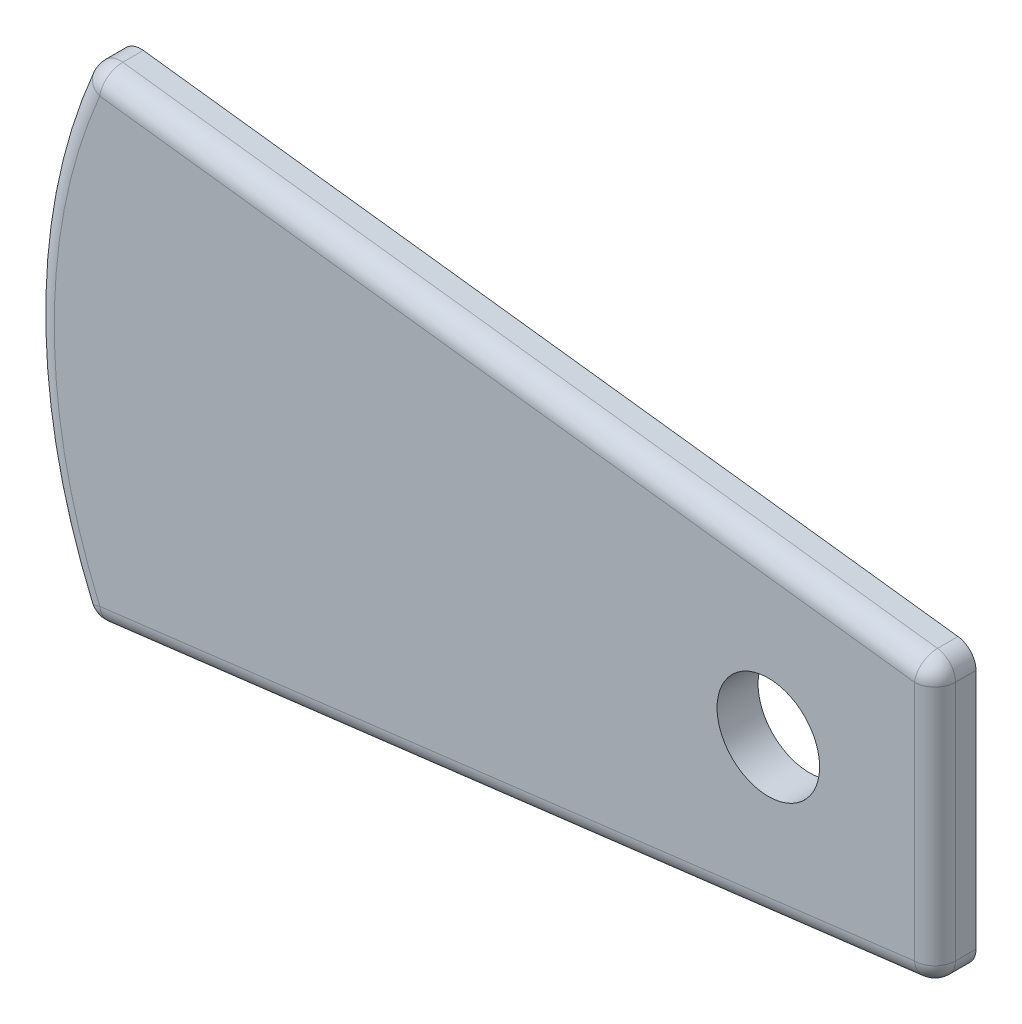
ISO-10303-21;
HEADER;
FILE_DESCRIPTION(('STEP AP214'),'2;1');
FILE_NAME('part.step','',(''),(''),'','','');
FILE_SCHEMA(('AUTOMOTIVE_DESIGN { 1 0 10303 214 1 1 1 1 }'));
ENDSEC;
DATA;
#1=APPLICATION_CONTEXT('core data for automotive mechanical design processes');
#2=APPLICATION_PROTOCOL_DEFINITION('international standard','automotive_design',2000,#1);
#3=PRODUCT_CONTEXT('',#1,'mechanical');
#4=PRODUCT('Part','Part','',(#3));
#5=PRODUCT_RELATED_PRODUCT_CATEGORY('part','',(#4));
#6=PRODUCT_DEFINITION_FORMATION('','',#4);
#7=PRODUCT_DEFINITION_CONTEXT('part definition',#1,'design');
#8=PRODUCT_DEFINITION('design','',#6,#7);
#9=PRODUCT_DEFINITION_SHAPE('','',#8);
#10=(LENGTH_UNIT() NAMED_UNIT(*) SI_UNIT(.MILLI.,.METRE.));
#11=(NAMED_UNIT(*) PLANE_ANGLE_UNIT() SI_UNIT($,.RADIAN.));
#12=(NAMED_UNIT(*) SI_UNIT($,.STERADIAN.) SOLID_ANGLE_UNIT());
#13=UNCERTAINTY_MEASURE_WITH_UNIT(LENGTH_MEASURE(1.E-05),#10,'distance_accuracy_value','');
#14=(GEOMETRIC_REPRESENTATION_CONTEXT(3) GLOBAL_UNCERTAINTY_ASSIGNED_CONTEXT((#13)) GLOBAL_UNIT_ASSIGNED_CONTEXT((#10,
#11,#12)) REPRESENTATION_CONTEXT('',''));
#15=CARTESIAN_POINT('',(0.,0.,0.));
#16=DIRECTION('',(0.,0.,1.));
#17=DIRECTION('',(1.,0.,0.));
#18=AXIS2_PLACEMENT_3D('',#15,#16,#17);
#19=CARTESIAN_POINT('',(-47.5934740970987,40.,2.));
#20=DIRECTION('',(0.,0.,-1.));
#21=DIRECTION('',(-1.,0.,0.));
#22=AXIS2_PLACEMENT_3D('',#19,#20,#21);
#23=CYLINDRICAL_SURFACE('',#22,28.2250701026764);
#24=DIRECTION('',(0.,0.,-1.));
#25=VECTOR('',#24,1.);
#26=CARTESIAN_POINT('',(-73.5154300505367,28.8327809258966,2.));
#27=LINE('',#26,#25);
#28=CARTESIAN_POINT('',(-73.5154300505367,28.8327809258966,0.));
#29=VERTEX_POINT('',#28);
#30=CARTESIAN_POINT('',(-73.5154300505367,28.8327809258966,1.));
#31=VERTEX_POINT('',#30);
#32=EDGE_CURVE('E124',#29,#31,#27,.F.);
#33=ORIENTED_EDGE('',*,*,#32,.T.);
#34=CARTESIAN_POINT('',(-47.5934740970987,40.,1.));
#35=DIRECTION('',(0.,0.,-1.));
#36=DIRECTION('',(-1.,0.,0.));
#37=AXIS2_PLACEMENT_3D('',#34,#35,#36);
#38=CIRCLE('',#37,28.2250701026764);
#39=CARTESIAN_POINT('',(-73.5154300505367,51.1672190741034,1.));
#40=VERTEX_POINT('',#39);
#41=EDGE_CURVE('E11',#31,#40,#38,.T.);
#42=ORIENTED_EDGE('',*,*,#41,.T.);
#43=DIRECTION('',(0.,0.,-1.));
#44=VECTOR('',#43,1.);
#45=CARTESIAN_POINT('',(-73.5154300505367,51.1672190741034,2.));
#46=LINE('',#45,#44);
#47=CARTESIAN_POINT('',(-73.5154300505367,51.1672190741034,0.));
#48=VERTEX_POINT('',#47);
#49=EDGE_CURVE('E128',#40,#48,#46,.T.);
#50=ORIENTED_EDGE('',*,*,#49,.T.);
#51=CARTESIAN_POINT('',(-47.5934740970987,40.,0.));
#52=DIRECTION('',(0.,0.,1.));
#53=DIRECTION('',(-1.,0.,0.));
#54=AXIS2_PLACEMENT_3D('',#51,#52,#53);
#55=CIRCLE('',#54,28.2250701026764);
#56=EDGE_CURVE('E135',#48,#29,#55,.T.);
#57=ORIENTED_EDGE('',*,*,#56,.T.);
#58=EDGE_LOOP('',(#33,#42,#50,#57));
#59=FACE_BOUND('',#58,.T.);
#60=ADVANCED_FACE('F35',(#59),#23,.T.);
#61=CARTESIAN_POINT('',(-31.8738828691352,33.2309933523723,2.));
#62=DIRECTION('',(-0.122107751234225,0.99251684977562,0.));
#63=DIRECTION('',(-0.99251684977562,-0.122107751234225,0.));
#64=AXIS2_PLACEMENT_3D('',#61,#62,#63);
#65=PLANE('',#64);
#66=DIRECTION('',(0.,0.,-1.));
#67=VECTOR('',#66,1.);
#68=CARTESIAN_POINT('',(-32.751775117901,33.1229876813885,2.));
#69=LINE('',#68,#67);
#70=CARTESIAN_POINT('',(-32.751775117901,33.1229876813885,0.));
#71=VERTEX_POINT('',#70);
#72=CARTESIAN_POINT('',(-32.751775117901,33.1229876813885,1.));
#73=VERTEX_POINT('',#72);
#74=EDGE_CURVE('E120',#71,#73,#69,.F.);
#75=ORIENTED_EDGE('',*,*,#74,.T.);
#76=DIRECTION('',(0.99251684977562,0.122107751234225,0.));
#77=VECTOR('',#76,1.);
#78=CARTESIAN_POINT('',(-31.8738828691352,33.2309933523723,1.));
#79=LINE('',#78,#77);
#80=CARTESIAN_POINT('',(-72.4749204721629,28.2359130163531,1.));
#81=VERTEX_POINT('',#80);
#82=EDGE_CURVE('E59',#73,#81,#79,.F.);
#83=ORIENTED_EDGE('',*,*,#82,.T.);
#84=DIRECTION('',(0.,0.,-1.));
#85=VECTOR('',#84,1.);
#86=CARTESIAN_POINT('',(-72.4749204721629,28.2359130163531,2.));
#87=LINE('',#86,#85);
#88=CARTESIAN_POINT('',(-72.4749204721629,28.2359130163531,0.));
#89=VERTEX_POINT('',#88);
#90=EDGE_CURVE('E112',#81,#89,#87,.T.);
#91=ORIENTED_EDGE('',*,*,#90,.T.);
#92=DIRECTION('',(0.99251684977562,0.122107751234225,0.));
#93=VECTOR('',#92,1.);
#94=CARTESIAN_POINT('',(-31.8738828691352,33.2309933523723,0.));
#95=LINE('',#94,#93);
#96=EDGE_CURVE('E116',#89,#71,#95,.T.);
#97=ORIENTED_EDGE('',*,*,#96,.T.);
#98=EDGE_LOOP('',(#75,#83,#91,#97));
#99=FACE_BOUND('',#98,.T.);
#100=ADVANCED_FACE('F114',(#99),#65,.F.);
#101=CARTESIAN_POINT('',(-31.8738828691352,46.7690066476277,2.));
#102=DIRECTION('',(-1.,0.,0.));
#103=DIRECTION('',(0.,0.,1.));
#104=AXIS2_PLACEMENT_3D('',#101,#102,#103);
#105=PLANE('',#104);
#106=DIRECTION('',(0.,0.,-1.));
#107=VECTOR('',#106,1.);
#108=CARTESIAN_POINT('',(-31.8738828691352,45.8844954688359,2.));
#109=LINE('',#108,#107);
#110=CARTESIAN_POINT('',(-31.8738828691352,45.8844954688359,0.));
#111=VERTEX_POINT('',#110);
#112=CARTESIAN_POINT('',(-31.8738828691352,45.8844954688359,1.));
#113=VERTEX_POINT('',#112);
#114=EDGE_CURVE('E159',#111,#113,#109,.F.);
#115=ORIENTED_EDGE('',*,*,#114,.T.);
#116=DIRECTION('',(0.,1.,0.));
#117=VECTOR('',#116,1.);
#118=CARTESIAN_POINT('',(-31.8738828691352,46.7690066476277,1.));
#119=LINE('',#118,#117);
#120=CARTESIAN_POINT('',(-31.8738828691352,34.1155045311641,1.));
#121=VERTEX_POINT('',#120);
#122=EDGE_CURVE('E178',#113,#121,#119,.F.);
#123=ORIENTED_EDGE('',*,*,#122,.T.);
#124=DIRECTION('',(0.,0.,-1.));
#125=VECTOR('',#124,1.);
#126=CARTESIAN_POINT('',(-31.8738828691352,34.1155045311641,2.));
#127=LINE('',#126,#125);
#128=CARTESIAN_POINT('',(-31.8738828691352,34.1155045311641,0.));
#129=VERTEX_POINT('',#128);
#130=EDGE_CURVE('E157',#121,#129,#127,.T.);
#131=ORIENTED_EDGE('',*,*,#130,.T.);
#132=DIRECTION('',(0.,1.,0.));
#133=VECTOR('',#132,1.);
#134=CARTESIAN_POINT('',(-31.8738828691352,46.7690066476277,0.));
#135=LINE('',#134,#133);
#136=EDGE_CURVE('E134',#129,#111,#135,.T.);
#137=ORIENTED_EDGE('',*,*,#136,.T.);
#138=EDGE_LOOP('',(#115,#123,#131,#137));
#139=FACE_BOUND('',#138,.T.);
#140=ADVANCED_FACE('F218',(#139),#105,.F.);
#141=CARTESIAN_POINT('',(-31.8738828691352,46.7690066476277,2.));
#142=DIRECTION('',(-0.122107751234225,-0.99251684977562,0.));
#143=DIRECTION('',(0.99251684977562,-0.122107751234225,0.));
#144=AXIS2_PLACEMENT_3D('',#141,#142,#143);
#145=PLANE('',#144);
#146=DIRECTION('',(0.,0.,-1.));
#147=VECTOR('',#146,1.);
#148=CARTESIAN_POINT('',(-72.4749204721629,51.7640869836469,2.));
#149=LINE('',#148,#147);
#150=CARTESIAN_POINT('',(-72.4749204721629,51.7640869836469,0.));
#151=VERTEX_POINT('',#150);
#152=CARTESIAN_POINT('',(-72.4749204721629,51.7640869836469,1.));
#153=VERTEX_POINT('',#152);
#154=EDGE_CURVE('E154',#151,#153,#149,.F.);
#155=ORIENTED_EDGE('',*,*,#154,.T.);
#156=DIRECTION('',(-0.99251684977562,0.122107751234225,0.));
#157=VECTOR('',#156,1.);
#158=CARTESIAN_POINT('',(-31.8738828691352,46.7690066476277,1.));
#159=LINE('',#158,#157);
#160=CARTESIAN_POINT('',(-32.751775117901,46.8770123186115,1.));
#161=VERTEX_POINT('',#160);
#162=EDGE_CURVE('E174',#153,#161,#159,.F.);
#163=ORIENTED_EDGE('',*,*,#162,.T.);
#164=DIRECTION('',(0.,0.,-1.));
#165=VECTOR('',#164,1.);
#166=CARTESIAN_POINT('',(-32.751775117901,46.8770123186115,2.));
#167=LINE('',#166,#165);
#168=CARTESIAN_POINT('',(-32.751775117901,46.8770123186115,0.));
#169=VERTEX_POINT('',#168);
#170=EDGE_CURVE('E152',#161,#169,#167,.T.);
#171=ORIENTED_EDGE('',*,*,#170,.T.);
#172=DIRECTION('',(-0.99251684977562,0.122107751234225,0.));
#173=VECTOR('',#172,1.);
#174=CARTESIAN_POINT('',(-31.8738828691352,46.7690066476277,0.));
#175=LINE('',#174,#173);
#176=EDGE_CURVE('E138',#169,#151,#175,.T.);
#177=ORIENTED_EDGE('',*,*,#176,.T.);
#178=EDGE_LOOP('',(#155,#163,#171,#177));
#179=FACE_BOUND('',#178,.T.);
#180=ADVANCED_FACE('F318',(#179),#145,.F.);
#181=CARTESIAN_POINT('',(-47.5934740970987,40.,2.));
#182=DIRECTION('',(0.,0.,-1.));
#183=DIRECTION('',(-1.,0.,0.));
#184=AXIS2_PLACEMENT_3D('',#181,#182,#183);
#185=PLANE('',#184);
#186=CARTESIAN_POINT('',(-40.,40.,2.));
#187=DIRECTION('',(0.,0.,1.));
#188=DIRECTION('',(1.,0.,0.));
#189=AXIS2_PLACEMENT_3D('',#186,#187,#188);
#190=CIRCLE('',#189,2.5);
#191=CARTESIAN_POINT('',(-37.5,40.,2.));
#192=VERTEX_POINT('',#191);
#193=EDGE_CURVE('E420',#192,#192,#190,.T.);
#194=ORIENTED_EDGE('',*,*,#193,.F.);
#195=EDGE_LOOP('',(#194));
#196=FACE_BOUND('',#195,.T.);
#197=DIRECTION('',(0.,1.,0.));
#198=VECTOR('',#197,1.);
#199=CARTESIAN_POINT('',(-32.8738828691352,40.,2.));
#200=LINE('',#199,#198);
#201=CARTESIAN_POINT('',(-32.8738828691352,34.1155045311641,2.));
#202=VERTEX_POINT('',#201);
#203=CARTESIAN_POINT('',(-32.8738828691352,45.8844954688359,2.));
#204=VERTEX_POINT('',#203);
#205=EDGE_CURVE('E169',#202,#204,#200,.T.);
#206=ORIENTED_EDGE('',*,*,#205,.T.);
#207=DIRECTION('',(-0.99251684977562,0.122107751234225,0.));
#208=VECTOR('',#207,1.);
#209=CARTESIAN_POINT('',(-46.6608349858454,47.5806820068538,2.));
#210=LINE('',#209,#208);
#211=CARTESIAN_POINT('',(-72.5970282233972,50.7715701338712,2.));
#212=VERTEX_POINT('',#211);
#213=EDGE_CURVE('E171',#204,#212,#210,.T.);
#214=ORIENTED_EDGE('',*,*,#213,.T.);
#215=CARTESIAN_POINT('',(-47.5934740970987,40.,2.));
#216=DIRECTION('',(0.,0.,-1.));
#217=DIRECTION('',(-1.,0.,0.));
#218=AXIS2_PLACEMENT_3D('',#215,#216,#217);
#219=CIRCLE('',#218,27.2250701026764);
#220=CARTESIAN_POINT('',(-72.5970282233972,29.2284298661288,2.));
#221=VERTEX_POINT('',#220);
#222=EDGE_CURVE('E165',#212,#221,#219,.F.);
#223=ORIENTED_EDGE('',*,*,#222,.T.);
#224=DIRECTION('',(0.99251684977562,0.122107751234225,0.));
#225=VECTOR('',#224,1.);
#226=CARTESIAN_POINT('',(-46.6608349858454,32.4193179931462,2.));
#227=LINE('',#226,#225);
#228=EDGE_CURVE('E167',#221,#202,#227,.T.);
#229=ORIENTED_EDGE('',*,*,#228,.T.);
#230=EDGE_LOOP('',(#206,#214,#223,#229));
#231=FACE_BOUND('',#230,.T.);
#232=ADVANCED_FACE('F236',(#196,#231),#185,.F.);
#233=CARTESIAN_POINT('',(-47.5934740970987,40.,0.));
#234=DIRECTION('',(0.,0.,-1.));
#235=DIRECTION('',(-1.,0.,0.));
#236=AXIS2_PLACEMENT_3D('',#233,#234,#235);
#237=PLANE('',#236);
#238=CARTESIAN_POINT('',(-40.,40.,0.));
#239=DIRECTION('',(0.,0.,1.));
#240=DIRECTION('',(1.,0.,0.));
#241=AXIS2_PLACEMENT_3D('',#238,#239,#240);
#242=CIRCLE('',#241,2.5);
#243=CARTESIAN_POINT('',(-37.5,40.,0.));
#244=VERTEX_POINT('',#243);
#245=EDGE_CURVE('E187',#244,#244,#242,.T.);
#246=ORIENTED_EDGE('',*,*,#245,.T.);
#247=EDGE_LOOP('',(#246));
#248=FACE_BOUND('',#247,.T.);
#249=ORIENTED_EDGE('',*,*,#96,.F.);
#250=CARTESIAN_POINT('',(-72.5970282233972,29.2284298661288,0.));
#251=DIRECTION('',(0.,0.,-1.));
#252=DIRECTION('',(-1.,0.,0.));
#253=AXIS2_PLACEMENT_3D('',#250,#251,#252);
#254=CIRCLE('',#253,1.);
#255=EDGE_CURVE('E122',#89,#29,#254,.T.);
#256=ORIENTED_EDGE('',*,*,#255,.T.);
#257=ORIENTED_EDGE('',*,*,#56,.F.);
#258=CARTESIAN_POINT('',(-72.5970282233972,50.7715701338712,0.));
#259=DIRECTION('',(0.,0.,-1.));
#260=DIRECTION('',(-1.,0.,0.));
#261=AXIS2_PLACEMENT_3D('',#258,#259,#260);
#262=CIRCLE('',#261,1.);
#263=EDGE_CURVE('E129',#48,#151,#262,.T.);
#264=ORIENTED_EDGE('',*,*,#263,.T.);
#265=ORIENTED_EDGE('',*,*,#176,.F.);
#266=CARTESIAN_POINT('',(-32.8738828691352,45.8844954688359,0.));
#267=DIRECTION('',(0.,0.,-1.));
#268=DIRECTION('',(-1.,0.,0.));
#269=AXIS2_PLACEMENT_3D('',#266,#267,#268);
#270=CIRCLE('',#269,1.);
#271=EDGE_CURVE('E147',#169,#111,#270,.T.);
#272=ORIENTED_EDGE('',*,*,#271,.T.);
#273=ORIENTED_EDGE('',*,*,#136,.F.);
#274=CARTESIAN_POINT('',(-32.8738828691352,34.1155045311641,0.));
#275=DIRECTION('',(0.,0.,-1.));
#276=DIRECTION('',(-1.,0.,0.));
#277=AXIS2_PLACEMENT_3D('',#274,#275,#276);
#278=CIRCLE('',#277,1.);
#279=EDGE_CURVE('E119',#129,#71,#278,.T.);
#280=ORIENTED_EDGE('',*,*,#279,.T.);
#281=EDGE_LOOP('',(#249,#256,#257,#264,#265,#272,#273,#280));
#282=FACE_BOUND('',#281,.T.);
#283=ADVANCED_FACE('F131',(#248,#282),#237,.T.);
#284=CARTESIAN_POINT('',(-72.5970282233972,29.2284298661288,2.));
#285=DIRECTION('',(0.,0.,-1.));
#286=DIRECTION('',(-1.,0.,0.));
#287=AXIS2_PLACEMENT_3D('',#284,#285,#286);
#288=CYLINDRICAL_SURFACE('',#287,1.);
#289=ORIENTED_EDGE('',*,*,#90,.F.);
#290=CARTESIAN_POINT('',(-72.5970282233972,29.2284298661288,1.));
#291=DIRECTION('',(0.,0.,-1.));
#292=DIRECTION('',(-1.,0.,0.));
#293=AXIS2_PLACEMENT_3D('',#290,#291,#292);
#294=CIRCLE('',#293,1.);
#295=EDGE_CURVE('E44',#81,#31,#294,.T.);
#296=ORIENTED_EDGE('',*,*,#295,.T.);
#297=ORIENTED_EDGE('',*,*,#32,.F.);
#298=ORIENTED_EDGE('',*,*,#255,.F.);
#299=EDGE_LOOP('',(#289,#296,#297,#298));
#300=FACE_BOUND('',#299,.T.);
#301=ADVANCED_FACE('F123',(#300),#288,.T.);
#302=CARTESIAN_POINT('',(-72.5970282233972,50.7715701338712,2.));
#303=DIRECTION('',(0.,0.,-1.));
#304=DIRECTION('',(-1.,0.,0.));
#305=AXIS2_PLACEMENT_3D('',#302,#303,#304);
#306=CYLINDRICAL_SURFACE('',#305,1.);
#307=ORIENTED_EDGE('',*,*,#49,.F.);
#308=CARTESIAN_POINT('',(-72.5970282233972,50.7715701338712,1.));
#309=DIRECTION('',(0.,0.,-1.));
#310=DIRECTION('',(-1.,0.,0.));
#311=AXIS2_PLACEMENT_3D('',#308,#309,#310);
#312=CIRCLE('',#311,1.);
#313=EDGE_CURVE('E162',#40,#153,#312,.T.);
#314=ORIENTED_EDGE('',*,*,#313,.T.);
#315=ORIENTED_EDGE('',*,*,#154,.F.);
#316=ORIENTED_EDGE('',*,*,#263,.F.);
#317=EDGE_LOOP('',(#307,#314,#315,#316));
#318=FACE_BOUND('',#317,.T.);
#319=ADVANCED_FACE('F250',(#318),#306,.T.);
#320=CARTESIAN_POINT('',(-32.8738828691352,45.8844954688359,2.));
#321=DIRECTION('',(0.,0.,-1.));
#322=DIRECTION('',(-1.,0.,0.));
#323=AXIS2_PLACEMENT_3D('',#320,#321,#322);
#324=CYLINDRICAL_SURFACE('',#323,1.);
#325=ORIENTED_EDGE('',*,*,#170,.F.);
#326=CARTESIAN_POINT('',(-32.8738828691352,45.8844954688359,1.));
#327=DIRECTION('',(0.,0.,-1.));
#328=DIRECTION('',(-1.,0.,0.));
#329=AXIS2_PLACEMENT_3D('',#326,#327,#328);
#330=CIRCLE('',#329,1.);
#331=EDGE_CURVE('E176',#161,#113,#330,.T.);
#332=ORIENTED_EDGE('',*,*,#331,.T.);
#333=ORIENTED_EDGE('',*,*,#114,.F.);
#334=ORIENTED_EDGE('',*,*,#271,.F.);
#335=EDGE_LOOP('',(#325,#332,#333,#334));
#336=FACE_BOUND('',#335,.T.);
#337=ADVANCED_FACE('F223',(#336),#324,.T.);
#338=CARTESIAN_POINT('',(-32.8738828691352,34.1155045311641,2.));
#339=DIRECTION('',(0.,0.,-1.));
#340=DIRECTION('',(-1.,0.,0.));
#341=AXIS2_PLACEMENT_3D('',#338,#339,#340);
#342=CYLINDRICAL_SURFACE('',#341,1.);
#343=ORIENTED_EDGE('',*,*,#130,.F.);
#344=CARTESIAN_POINT('',(-32.8738828691352,34.1155045311641,1.));
#345=DIRECTION('',(0.,0.,-1.));
#346=DIRECTION('',(-1.,0.,0.));
#347=AXIS2_PLACEMENT_3D('',#344,#345,#346);
#348=CIRCLE('',#347,1.);
#349=EDGE_CURVE('E180',#121,#73,#348,.T.);
#350=ORIENTED_EDGE('',*,*,#349,.T.);
#351=ORIENTED_EDGE('',*,*,#74,.F.);
#352=ORIENTED_EDGE('',*,*,#279,.F.);
#353=EDGE_LOOP('',(#343,#350,#351,#352));
#354=FACE_BOUND('',#353,.T.);
#355=ADVANCED_FACE('F216',(#354),#342,.T.);
#356=CARTESIAN_POINT('',(-32.8738828691352,34.1155045311641,1.));
#357=DIRECTION('',(0.,0.,-1.));
#358=DIRECTION('',(-1.,0.,0.));
#359=AXIS2_PLACEMENT_3D('',#356,#357,#358);
#360=SPHERICAL_SURFACE('',#359,1.);
#361=CARTESIAN_POINT('',(-32.8738828691352,34.1155045311641,1.));
#362=DIRECTION('',(-0.99251684977562,-0.122107751234223,0.));
#363=DIRECTION('',(0.122107751234223,-0.99251684977562,0.));
#364=AXIS2_PLACEMENT_3D('',#361,#362,#363);
#365=CIRCLE('',#364,1.);
#366=EDGE_CURVE('E200',#73,#202,#365,.T.);
#367=ORIENTED_EDGE('',*,*,#366,.F.);
#368=ORIENTED_EDGE('',*,*,#349,.F.);
#369=CARTESIAN_POINT('',(-32.8738828691352,34.1155045311641,1.));
#370=DIRECTION('',(0.,1.,0.));
#371=DIRECTION('',(0.,0.,1.));
#372=AXIS2_PLACEMENT_3D('',#369,#370,#371);
#373=CIRCLE('',#372,1.);
#374=EDGE_CURVE('E39',#202,#121,#373,.T.);
#375=ORIENTED_EDGE('',*,*,#374,.F.);
#376=EDGE_LOOP('',(#367,#368,#375));
#377=FACE_BOUND('',#376,.T.);
#378=ADVANCED_FACE('F37',(#377),#360,.T.);
#379=CARTESIAN_POINT('',(-32.8738828691352,40.,1.));
#380=DIRECTION('',(0.,1.,0.));
#381=DIRECTION('',(0.,0.,1.));
#382=AXIS2_PLACEMENT_3D('',#379,#380,#381);
#383=CYLINDRICAL_SURFACE('',#382,1.);
#384=ORIENTED_EDGE('',*,*,#374,.T.);
#385=ORIENTED_EDGE('',*,*,#122,.F.);
#386=CARTESIAN_POINT('',(-32.8738828691352,45.8844954688359,1.));
#387=DIRECTION('',(0.,1.,0.));
#388=DIRECTION('',(0.,0.,1.));
#389=AXIS2_PLACEMENT_3D('',#386,#387,#388);
#390=CIRCLE('',#389,1.);
#391=EDGE_CURVE('E198',#204,#113,#390,.T.);
#392=ORIENTED_EDGE('',*,*,#391,.F.);
#393=ORIENTED_EDGE('',*,*,#205,.F.);
#394=EDGE_LOOP('',(#384,#385,#392,#393));
#395=FACE_BOUND('',#394,.T.);
#396=ADVANCED_FACE('F210',(#395),#383,.T.);
#397=CARTESIAN_POINT('',(-46.6608349858454,32.4193179931462,1.));
#398=DIRECTION('',(0.99251684977562,0.122107751234225,0.));
#399=DIRECTION('',(-0.122107751234225,0.99251684977562,0.));
#400=AXIS2_PLACEMENT_3D('',#397,#398,#399);
#401=CYLINDRICAL_SURFACE('',#400,1.);
#402=ORIENTED_EDGE('',*,*,#366,.T.);
#403=ORIENTED_EDGE('',*,*,#228,.F.);
#404=CARTESIAN_POINT('',(-72.5970282233972,29.2284298661288,1.));
#405=DIRECTION('',(-0.99251684977562,-0.122107751234224,0.));
#406=DIRECTION('',(0.122107751234224,-0.99251684977562,0.));
#407=AXIS2_PLACEMENT_3D('',#404,#405,#406);
#408=CIRCLE('',#407,1.);
#409=EDGE_CURVE('E195',#81,#221,#408,.T.);
#410=ORIENTED_EDGE('',*,*,#409,.F.);
#411=ORIENTED_EDGE('',*,*,#82,.F.);
#412=EDGE_LOOP('',(#402,#403,#410,#411));
#413=FACE_BOUND('',#412,.T.);
#414=ADVANCED_FACE('F237',(#413),#401,.T.);
#415=CARTESIAN_POINT('',(-32.8738828691352,45.8844954688359,1.));
#416=DIRECTION('',(0.,0.,-1.));
#417=DIRECTION('',(-1.,0.,0.));
#418=AXIS2_PLACEMENT_3D('',#415,#416,#417);
#419=SPHERICAL_SURFACE('',#418,1.);
#420=ORIENTED_EDGE('',*,*,#391,.T.);
#421=ORIENTED_EDGE('',*,*,#331,.F.);
#422=CARTESIAN_POINT('',(-32.8738828691352,45.8844954688359,1.));
#423=DIRECTION('',(-0.99251684977562,0.122107751234224,0.));
#424=DIRECTION('',(-0.122107751234224,-0.99251684977562,0.));
#425=AXIS2_PLACEMENT_3D('',#422,#423,#424);
#426=CIRCLE('',#425,1.);
#427=EDGE_CURVE('E192',#204,#161,#426,.T.);
#428=ORIENTED_EDGE('',*,*,#427,.F.);
#429=EDGE_LOOP('',(#420,#421,#428));
#430=FACE_BOUND('',#429,.T.);
#431=ADVANCED_FACE('F228',(#430),#419,.T.);
#432=CARTESIAN_POINT('',(-72.5970282233972,29.2284298661288,1.));
#433=DIRECTION('',(0.,0.,-1.));
#434=DIRECTION('',(-1.,0.,0.));
#435=AXIS2_PLACEMENT_3D('',#432,#433,#434);
#436=SPHERICAL_SURFACE('',#435,1.);
#437=ORIENTED_EDGE('',*,*,#295,.F.);
#438=ORIENTED_EDGE('',*,*,#409,.T.);
#439=CARTESIAN_POINT('',(-72.5970282233972,29.2284298661288,1.));
#440=DIRECTION('',(-0.395648940232197,0.918401827139482,0.));
#441=DIRECTION('',(-0.918401827139482,-0.395648940232197,0.));
#442=AXIS2_PLACEMENT_3D('',#439,#440,#441);
#443=CIRCLE('',#442,1.);
#444=EDGE_CURVE('E189',#31,#221,#443,.T.);
#445=ORIENTED_EDGE('',*,*,#444,.F.);
#446=EDGE_LOOP('',(#437,#438,#445));
#447=FACE_BOUND('',#446,.T.);
#448=ADVANCED_FACE('F240',(#447),#436,.T.);
#449=CARTESIAN_POINT('',(-46.6608349858454,47.5806820068538,1.));
#450=DIRECTION('',(-0.99251684977562,0.122107751234225,0.));
#451=DIRECTION('',(-0.122107751234225,-0.99251684977562,0.));
#452=AXIS2_PLACEMENT_3D('',#449,#450,#451);
#453=CYLINDRICAL_SURFACE('',#452,1.);
#454=ORIENTED_EDGE('',*,*,#427,.T.);
#455=ORIENTED_EDGE('',*,*,#162,.F.);
#456=CARTESIAN_POINT('',(-72.5970282233972,50.7715701338712,1.));
#457=DIRECTION('',(-0.99251684977562,0.122107751234225,0.));
#458=DIRECTION('',(-0.122107751234225,-0.99251684977562,0.));
#459=AXIS2_PLACEMENT_3D('',#456,#457,#458);
#460=CIRCLE('',#459,1.);
#461=EDGE_CURVE('E186',#212,#153,#460,.T.);
#462=ORIENTED_EDGE('',*,*,#461,.F.);
#463=ORIENTED_EDGE('',*,*,#213,.F.);
#464=EDGE_LOOP('',(#454,#455,#462,#463));
#465=FACE_BOUND('',#464,.T.);
#466=ADVANCED_FACE('F232',(#465),#453,.T.);
#467=CARTESIAN_POINT('',(-47.5934740970987,40.,1.));
#468=DIRECTION('',(0.,0.,-1.));
#469=DIRECTION('',(-1.,0.,0.));
#470=AXIS2_PLACEMENT_3D('',#467,#468,#469);
#471=TOROIDAL_SURFACE('',#470,27.2250701026764,1.);
#472=ORIENTED_EDGE('',*,*,#444,.T.);
#473=ORIENTED_EDGE('',*,*,#222,.F.);
#474=CARTESIAN_POINT('',(-72.5970282233972,50.7715701338712,1.));
#475=DIRECTION('',(0.395648940232197,0.918401827139482,0.));
#476=DIRECTION('',(-0.918401827139482,0.395648940232197,0.));
#477=AXIS2_PLACEMENT_3D('',#474,#475,#476);
#478=CIRCLE('',#477,1.);
#479=EDGE_CURVE('E184',#40,#212,#478,.T.);
#480=ORIENTED_EDGE('',*,*,#479,.F.);
#481=ORIENTED_EDGE('',*,*,#41,.F.);
#482=EDGE_LOOP('',(#472,#473,#480,#481));
#483=FACE_BOUND('',#482,.T.);
#484=ADVANCED_FACE('F243',(#483),#471,.T.);
#485=CARTESIAN_POINT('',(-72.5970282233972,50.7715701338712,1.));
#486=DIRECTION('',(0.,0.,-1.));
#487=DIRECTION('',(-1.,0.,0.));
#488=AXIS2_PLACEMENT_3D('',#485,#486,#487);
#489=SPHERICAL_SURFACE('',#488,1.);
#490=ORIENTED_EDGE('',*,*,#461,.T.);
#491=ORIENTED_EDGE('',*,*,#313,.F.);
#492=ORIENTED_EDGE('',*,*,#479,.T.);
#493=EDGE_LOOP('',(#490,#491,#492));
#494=FACE_BOUND('',#493,.T.);
#495=ADVANCED_FACE('F253',(#494),#489,.T.);
#496=CARTESIAN_POINT('',(-40.,40.,0.));
#497=DIRECTION('',(0.,0.,1.));
#498=DIRECTION('',(1.,0.,0.));
#499=AXIS2_PLACEMENT_3D('',#496,#497,#498);
#500=CYLINDRICAL_SURFACE('',#499,2.5);
#501=ORIENTED_EDGE('',*,*,#245,.F.);
#502=EDGE_LOOP('',(#501));
#503=FACE_BOUND('',#502,.T.);
#504=ORIENTED_EDGE('',*,*,#193,.T.);
#505=EDGE_LOOP('',(#504));
#506=FACE_BOUND('',#505,.T.);
#507=ADVANCED_FACE('F255',(#503,#506),#500,.F.);
#508=CLOSED_SHELL('',(#60,#100,#140,#180,#232,#283,#301,#319,#337,#355,#378,#396,#414,#431,#448,
#466,#484,#495,#507));
#509=MANIFOLD_SOLID_BREP('B2',#508);
#510=ADVANCED_BREP_SHAPE_REPRESENTATION('',(#18,#509),#14);
#511=SHAPE_DEFINITION_REPRESENTATION(#9,#510);
ENDSEC;
END-ISO-10303-21;
